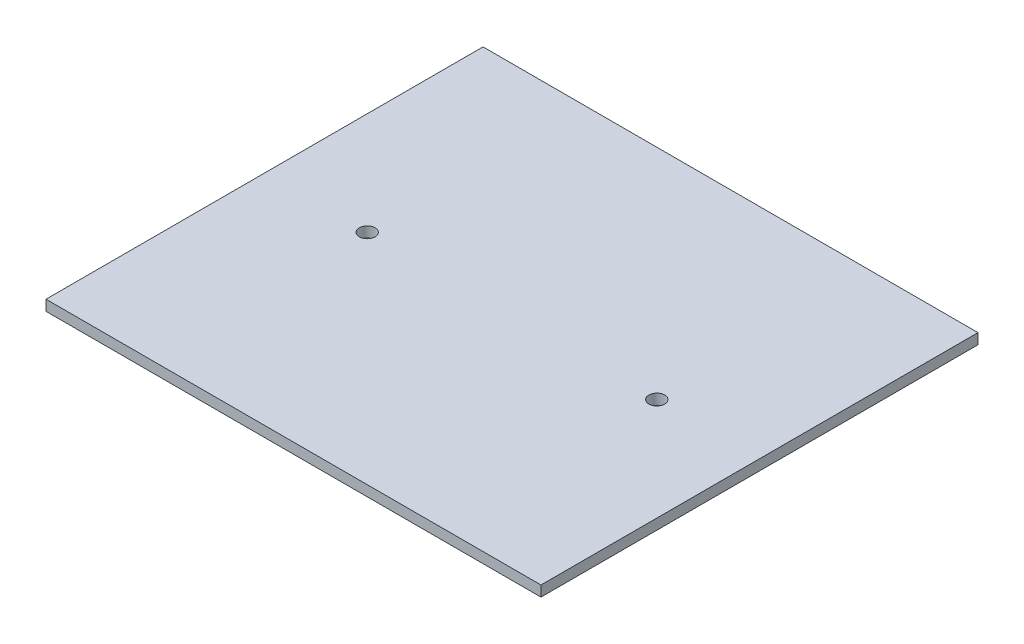
ISO-10303-21;
HEADER;
FILE_DESCRIPTION(('STEP AP214'),'2;1');
FILE_NAME('part.step','',(''),(''),'','','');
FILE_SCHEMA(('AUTOMOTIVE_DESIGN { 1 0 10303 214 1 1 1 1 }'));
ENDSEC;
DATA;
#1=APPLICATION_CONTEXT('core data for automotive mechanical design processes');
#2=APPLICATION_PROTOCOL_DEFINITION('international standard','automotive_design',2000,#1);
#3=PRODUCT_CONTEXT('',#1,'mechanical');
#4=PRODUCT('Part','Part','',(#3));
#5=PRODUCT_RELATED_PRODUCT_CATEGORY('part','',(#4));
#6=PRODUCT_DEFINITION_FORMATION('','',#4);
#7=PRODUCT_DEFINITION_CONTEXT('part definition',#1,'design');
#8=PRODUCT_DEFINITION('design','',#6,#7);
#9=PRODUCT_DEFINITION_SHAPE('','',#8);
#10=(LENGTH_UNIT() NAMED_UNIT(*) SI_UNIT(.MILLI.,.METRE.));
#11=(NAMED_UNIT(*) PLANE_ANGLE_UNIT() SI_UNIT($,.RADIAN.));
#12=(NAMED_UNIT(*) SI_UNIT($,.STERADIAN.) SOLID_ANGLE_UNIT());
#13=UNCERTAINTY_MEASURE_WITH_UNIT(LENGTH_MEASURE(1.E-05),#10,'distance_accuracy_value','');
#14=(GEOMETRIC_REPRESENTATION_CONTEXT(3) GLOBAL_UNCERTAINTY_ASSIGNED_CONTEXT((#13)) GLOBAL_UNIT_ASSIGNED_CONTEXT((#10,
#11,#12)) REPRESENTATION_CONTEXT('',''));
#15=CARTESIAN_POINT('',(0.,0.,0.));
#16=DIRECTION('',(0.,0.,1.));
#17=DIRECTION('',(1.,0.,0.));
#18=AXIS2_PLACEMENT_3D('',#15,#16,#17);
#19=CARTESIAN_POINT('',(47.,2.,41.5));
#20=DIRECTION('',(-1.,0.,0.));
#21=DIRECTION('',(0.,0.,1.));
#22=AXIS2_PLACEMENT_3D('',#19,#20,#21);
#23=PLANE('',#22);
#24=DIRECTION('',(0.,0.,-1.));
#25=VECTOR('',#24,1.);
#26=CARTESIAN_POINT('',(47.,0.,41.5));
#27=LINE('',#26,#25);
#28=CARTESIAN_POINT('',(47.,0.,41.5));
#29=VERTEX_POINT('',#28);
#30=CARTESIAN_POINT('',(47.,0.,-41.5));
#31=VERTEX_POINT('',#30);
#32=EDGE_CURVE('E109',#29,#31,#27,.T.);
#33=ORIENTED_EDGE('',*,*,#32,.T.);
#34=DIRECTION('',(0.,-1.,0.));
#35=VECTOR('',#34,1.);
#36=CARTESIAN_POINT('',(47.,2.,-41.5));
#37=LINE('',#36,#35);
#38=CARTESIAN_POINT('',(47.,2.,-41.5));
#39=VERTEX_POINT('',#38);
#40=EDGE_CURVE('E11',#39,#31,#37,.T.);
#41=ORIENTED_EDGE('',*,*,#40,.F.);
#42=DIRECTION('',(0.,0.,-1.));
#43=VECTOR('',#42,1.);
#44=CARTESIAN_POINT('',(47.,2.,41.5));
#45=LINE('',#44,#43);
#46=CARTESIAN_POINT('',(47.,2.,41.5));
#47=VERTEX_POINT('',#46);
#48=EDGE_CURVE('E93',#47,#39,#45,.T.);
#49=ORIENTED_EDGE('',*,*,#48,.F.);
#50=DIRECTION('',(0.,-1.,0.));
#51=VECTOR('',#50,1.);
#52=CARTESIAN_POINT('',(47.,2.,41.5));
#53=LINE('',#52,#51);
#54=EDGE_CURVE('E105',#47,#29,#53,.T.);
#55=ORIENTED_EDGE('',*,*,#54,.T.);
#56=EDGE_LOOP('',(#33,#41,#49,#55));
#57=FACE_BOUND('',#56,.T.);
#58=ADVANCED_FACE('F41',(#57),#23,.F.);
#59=CARTESIAN_POINT('',(-47.,2.,-41.5));
#60=DIRECTION('',(0.,0.,1.));
#61=DIRECTION('',(1.,0.,0.));
#62=AXIS2_PLACEMENT_3D('',#59,#60,#61);
#63=PLANE('',#62);
#64=DIRECTION('',(-1.,0.,0.));
#65=VECTOR('',#64,1.);
#66=CARTESIAN_POINT('',(-47.,0.,-41.5));
#67=LINE('',#66,#65);
#68=CARTESIAN_POINT('',(-47.,0.,-41.5));
#69=VERTEX_POINT('',#68);
#70=EDGE_CURVE('E98',#31,#69,#67,.T.);
#71=ORIENTED_EDGE('',*,*,#70,.T.);
#72=DIRECTION('',(0.,-1.,0.));
#73=VECTOR('',#72,1.);
#74=CARTESIAN_POINT('',(-47.,2.,-41.5));
#75=LINE('',#74,#73);
#76=CARTESIAN_POINT('',(-47.,2.,-41.5));
#77=VERTEX_POINT('',#76);
#78=EDGE_CURVE('E50',#77,#69,#75,.T.);
#79=ORIENTED_EDGE('',*,*,#78,.F.);
#80=DIRECTION('',(-1.,0.,0.));
#81=VECTOR('',#80,1.);
#82=CARTESIAN_POINT('',(-47.,2.,-41.5));
#83=LINE('',#82,#81);
#84=EDGE_CURVE('E88',#39,#77,#83,.T.);
#85=ORIENTED_EDGE('',*,*,#84,.F.);
#86=ORIENTED_EDGE('',*,*,#40,.T.);
#87=EDGE_LOOP('',(#71,#79,#85,#86));
#88=FACE_BOUND('',#87,.T.);
#89=ADVANCED_FACE('F97',(#88),#63,.F.);
#90=CARTESIAN_POINT('',(-47.,2.,41.5));
#91=DIRECTION('',(1.,0.,0.));
#92=DIRECTION('',(0.,0.,-1.));
#93=AXIS2_PLACEMENT_3D('',#90,#91,#92);
#94=PLANE('',#93);
#95=DIRECTION('',(0.,0.,1.));
#96=VECTOR('',#95,1.);
#97=CARTESIAN_POINT('',(-47.,0.,41.5));
#98=LINE('',#97,#96);
#99=CARTESIAN_POINT('',(-47.,0.,41.5));
#100=VERTEX_POINT('',#99);
#101=EDGE_CURVE('E75',#69,#100,#98,.T.);
#102=ORIENTED_EDGE('',*,*,#101,.T.);
#103=DIRECTION('',(0.,-1.,0.));
#104=VECTOR('',#103,1.);
#105=CARTESIAN_POINT('',(-47.,2.,41.5));
#106=LINE('',#105,#104);
#107=CARTESIAN_POINT('',(-47.,2.,41.5));
#108=VERTEX_POINT('',#107);
#109=EDGE_CURVE('E100',#108,#100,#106,.T.);
#110=ORIENTED_EDGE('',*,*,#109,.F.);
#111=DIRECTION('',(0.,0.,1.));
#112=VECTOR('',#111,1.);
#113=CARTESIAN_POINT('',(-47.,2.,41.5));
#114=LINE('',#113,#112);
#115=EDGE_CURVE('E91',#77,#108,#114,.T.);
#116=ORIENTED_EDGE('',*,*,#115,.F.);
#117=ORIENTED_EDGE('',*,*,#78,.T.);
#118=EDGE_LOOP('',(#102,#110,#116,#117));
#119=FACE_BOUND('',#118,.T.);
#120=ADVANCED_FACE('F101',(#119),#94,.F.);
#121=CARTESIAN_POINT('',(-47.,2.,41.5));
#122=DIRECTION('',(0.,0.,-1.));
#123=DIRECTION('',(-1.,0.,0.));
#124=AXIS2_PLACEMENT_3D('',#121,#122,#123);
#125=PLANE('',#124);
#126=DIRECTION('',(1.,0.,0.));
#127=VECTOR('',#126,1.);
#128=CARTESIAN_POINT('',(-47.,0.,41.5));
#129=LINE('',#128,#127);
#130=EDGE_CURVE('E81',#100,#29,#129,.T.);
#131=ORIENTED_EDGE('',*,*,#130,.T.);
#132=ORIENTED_EDGE('',*,*,#54,.F.);
#133=DIRECTION('',(1.,0.,0.));
#134=VECTOR('',#133,1.);
#135=CARTESIAN_POINT('',(-47.,2.,41.5));
#136=LINE('',#135,#134);
#137=EDGE_CURVE('E58',#108,#47,#136,.T.);
#138=ORIENTED_EDGE('',*,*,#137,.F.);
#139=ORIENTED_EDGE('',*,*,#109,.T.);
#140=EDGE_LOOP('',(#131,#132,#138,#139));
#141=FACE_BOUND('',#140,.T.);
#142=ADVANCED_FACE('F123',(#141),#125,.F.);
#143=CARTESIAN_POINT('',(0.,2.,0.));
#144=DIRECTION('',(0.,-1.,0.));
#145=DIRECTION('',(0.,0.,-1.));
#146=AXIS2_PLACEMENT_3D('',#143,#144,#145);
#147=PLANE('',#146);
#148=CARTESIAN_POINT('',(27.5,2.,0.));
#149=DIRECTION('',(0.,1.,0.));
#150=DIRECTION('',(0.,0.,1.));
#151=AXIS2_PLACEMENT_3D('',#148,#149,#150);
#152=CIRCLE('',#151,1.5);
#153=CARTESIAN_POINT('',(27.5,2.,1.5));
#154=VERTEX_POINT('',#153);
#155=EDGE_CURVE('E138',#154,#154,#152,.T.);
#156=ORIENTED_EDGE('',*,*,#155,.F.);
#157=EDGE_LOOP('',(#156));
#158=FACE_BOUND('',#157,.T.);
#159=CARTESIAN_POINT('',(-27.5,2.,0.));
#160=DIRECTION('',(0.,1.,0.));
#161=DIRECTION('',(0.,0.,-1.));
#162=AXIS2_PLACEMENT_3D('',#159,#160,#161);
#163=CIRCLE('',#162,1.5);
#164=CARTESIAN_POINT('',(-27.5,2.,-1.5));
#165=VERTEX_POINT('',#164);
#166=EDGE_CURVE('E130',#165,#165,#163,.T.);
#167=ORIENTED_EDGE('',*,*,#166,.F.);
#168=EDGE_LOOP('',(#167));
#169=FACE_BOUND('',#168,.T.);
#170=ORIENTED_EDGE('',*,*,#48,.T.);
#171=ORIENTED_EDGE('',*,*,#84,.T.);
#172=ORIENTED_EDGE('',*,*,#115,.T.);
#173=ORIENTED_EDGE('',*,*,#137,.T.);
#174=EDGE_LOOP('',(#170,#171,#172,#173));
#175=FACE_BOUND('',#174,.T.);
#176=ADVANCED_FACE('F89',(#158,#169,#175),#147,.F.);
#177=CARTESIAN_POINT('',(0.,0.,0.));
#178=DIRECTION('',(0.,-1.,0.));
#179=DIRECTION('',(0.,0.,-1.));
#180=AXIS2_PLACEMENT_3D('',#177,#178,#179);
#181=PLANE('',#180);
#182=CARTESIAN_POINT('',(27.5,0.,0.));
#183=DIRECTION('',(0.,1.,0.));
#184=DIRECTION('',(0.,0.,1.));
#185=AXIS2_PLACEMENT_3D('',#182,#183,#184);
#186=CIRCLE('',#185,1.5);
#187=CARTESIAN_POINT('',(27.5,0.,1.5));
#188=VERTEX_POINT('',#187);
#189=EDGE_CURVE('E113',#188,#188,#186,.T.);
#190=ORIENTED_EDGE('',*,*,#189,.T.);
#191=EDGE_LOOP('',(#190));
#192=FACE_BOUND('',#191,.T.);
#193=CARTESIAN_POINT('',(-27.5,0.,0.));
#194=DIRECTION('',(0.,1.,0.));
#195=DIRECTION('',(0.,0.,-1.));
#196=AXIS2_PLACEMENT_3D('',#193,#194,#195);
#197=CIRCLE('',#196,1.5);
#198=CARTESIAN_POINT('',(-27.5,0.,-1.5));
#199=VERTEX_POINT('',#198);
#200=EDGE_CURVE('E134',#199,#199,#197,.T.);
#201=ORIENTED_EDGE('',*,*,#200,.T.);
#202=EDGE_LOOP('',(#201));
#203=FACE_BOUND('',#202,.T.);
#204=ORIENTED_EDGE('',*,*,#32,.F.);
#205=ORIENTED_EDGE('',*,*,#130,.F.);
#206=ORIENTED_EDGE('',*,*,#101,.F.);
#207=ORIENTED_EDGE('',*,*,#70,.F.);
#208=EDGE_LOOP('',(#204,#205,#206,#207));
#209=FACE_BOUND('',#208,.T.);
#210=ADVANCED_FACE('F126',(#192,#203,#209),#181,.T.);
#211=CARTESIAN_POINT('',(-27.5,0.,0.));
#212=DIRECTION('',(0.,1.,0.));
#213=DIRECTION('',(0.,0.,1.));
#214=AXIS2_PLACEMENT_3D('',#211,#212,#213);
#215=CYLINDRICAL_SURFACE('',#214,1.5);
#216=ORIENTED_EDGE('',*,*,#200,.F.);
#217=EDGE_LOOP('',(#216));
#218=FACE_BOUND('',#217,.T.);
#219=ORIENTED_EDGE('',*,*,#166,.T.);
#220=EDGE_LOOP('',(#219));
#221=FACE_BOUND('',#220,.T.);
#222=ADVANCED_FACE('F151',(#218,#221),#215,.F.);
#223=CARTESIAN_POINT('',(27.5,0.,0.));
#224=DIRECTION('',(0.,1.,0.));
#225=DIRECTION('',(0.,0.,1.));
#226=AXIS2_PLACEMENT_3D('',#223,#224,#225);
#227=CYLINDRICAL_SURFACE('',#226,1.5);
#228=ORIENTED_EDGE('',*,*,#189,.F.);
#229=EDGE_LOOP('',(#228));
#230=FACE_BOUND('',#229,.T.);
#231=ORIENTED_EDGE('',*,*,#155,.T.);
#232=EDGE_LOOP('',(#231));
#233=FACE_BOUND('',#232,.T.);
#234=ADVANCED_FACE('F148',(#230,#233),#227,.F.);
#235=CLOSED_SHELL('',(#58,#89,#120,#142,#176,#210,#222,#234));
#236=MANIFOLD_SOLID_BREP('B2',#235);
#237=ADVANCED_BREP_SHAPE_REPRESENTATION('',(#18,#236),#14);
#238=SHAPE_DEFINITION_REPRESENTATION(#9,#237);
ENDSEC;
END-ISO-10303-21;
